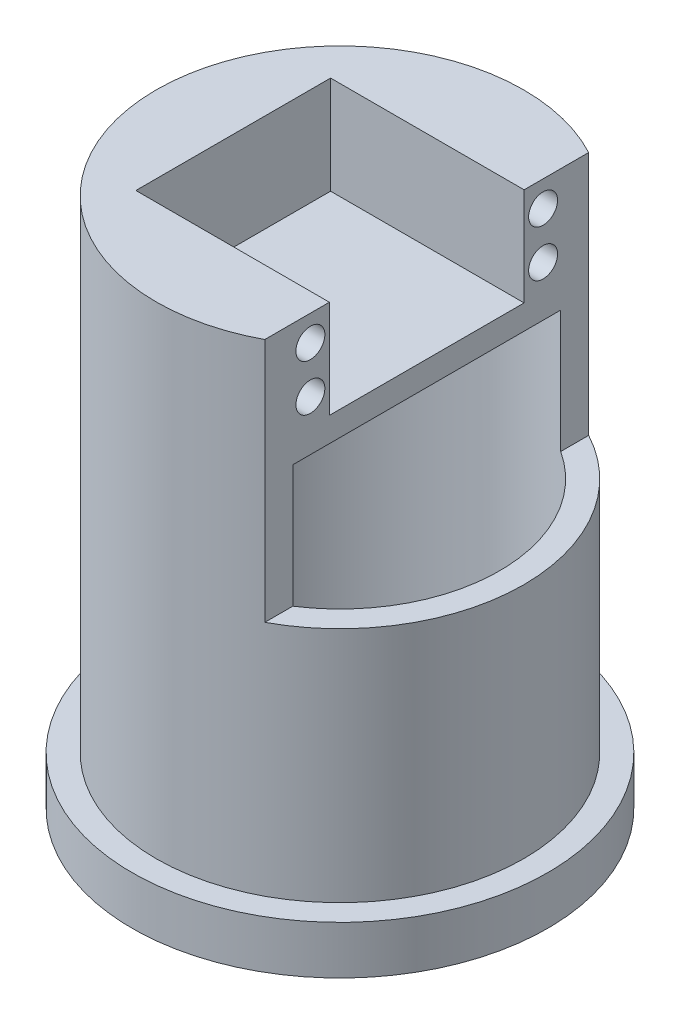
ISO-10303-21;
HEADER;
FILE_DESCRIPTION(('STEP AP214'),'2;1');
FILE_NAME('part.step','',(''),(''),'','','');
FILE_SCHEMA(('AUTOMOTIVE_DESIGN { 1 0 10303 214 1 1 1 1 }'));
ENDSEC;
DATA;
#1=APPLICATION_CONTEXT('core data for automotive mechanical design processes');
#2=APPLICATION_PROTOCOL_DEFINITION('international standard','automotive_design',2000,#1);
#3=PRODUCT_CONTEXT('',#1,'mechanical');
#4=PRODUCT('Part','Part','',(#3));
#5=PRODUCT_RELATED_PRODUCT_CATEGORY('part','',(#4));
#6=PRODUCT_DEFINITION_FORMATION('','',#4);
#7=PRODUCT_DEFINITION_CONTEXT('part definition',#1,'design');
#8=PRODUCT_DEFINITION('design','',#6,#7);
#9=PRODUCT_DEFINITION_SHAPE('','',#8);
#10=(LENGTH_UNIT() NAMED_UNIT(*) SI_UNIT(.MILLI.,.METRE.));
#11=(NAMED_UNIT(*) PLANE_ANGLE_UNIT() SI_UNIT($,.RADIAN.));
#12=(NAMED_UNIT(*) SI_UNIT($,.STERADIAN.) SOLID_ANGLE_UNIT());
#13=UNCERTAINTY_MEASURE_WITH_UNIT(LENGTH_MEASURE(1.E-05),#10,'distance_accuracy_value','');
#14=(GEOMETRIC_REPRESENTATION_CONTEXT(3) GLOBAL_UNCERTAINTY_ASSIGNED_CONTEXT((#13)) GLOBAL_UNIT_ASSIGNED_CONTEXT((#10,
#11,#12)) REPRESENTATION_CONTEXT('',''));
#15=CARTESIAN_POINT('',(0.,0.,0.));
#16=DIRECTION('',(0.,0.,1.));
#17=DIRECTION('',(1.,0.,0.));
#18=AXIS2_PLACEMENT_3D('',#15,#16,#17);
#19=CARTESIAN_POINT('',(0.,100.,0.));
#20=DIRECTION('',(0.,-1.,0.));
#21=DIRECTION('',(0.,0.,-1.));
#22=AXIS2_PLACEMENT_3D('',#19,#20,#21);
#23=CYLINDRICAL_SURFACE('',#22,38.1);
#24=CARTESIAN_POINT('',(0.,100.,0.));
#25=DIRECTION('',(0.,1.,0.));
#26=DIRECTION('',(0.,0.,1.));
#27=AXIS2_PLACEMENT_3D('',#24,#25,#26);
#28=CIRCLE('',#27,38.1);
#29=CARTESIAN_POINT('',(18.,100.,-33.5799047050464));
#30=VERTEX_POINT('',#29);
#31=CARTESIAN_POINT('',(18.,100.,33.5799047050464));
#32=VERTEX_POINT('',#31);
#33=EDGE_CURVE('E352',#30,#32,#28,.T.);
#34=ORIENTED_EDGE('',*,*,#33,.F.);
#35=DIRECTION('',(0.,-1.,0.));
#36=VECTOR('',#35,1.);
#37=CARTESIAN_POINT('',(18.,100.,-33.5799047050464));
#38=LINE('',#37,#36);
#39=CARTESIAN_POINT('',(18.,49.2,-33.5799047050464));
#40=VERTEX_POINT('',#39);
#41=EDGE_CURVE('E241',#30,#40,#38,.T.);
#42=ORIENTED_EDGE('',*,*,#41,.T.);
#43=CARTESIAN_POINT('',(0.,49.2,0.));
#44=DIRECTION('',(0.,-1.,0.));
#45=DIRECTION('',(0.,0.,-1.));
#46=AXIS2_PLACEMENT_3D('',#43,#44,#45);
#47=CIRCLE('',#46,38.1);
#48=CARTESIAN_POINT('',(18.,49.2,33.5799047050464));
#49=VERTEX_POINT('',#48);
#50=EDGE_CURVE('E245',#40,#49,#47,.T.);
#51=ORIENTED_EDGE('',*,*,#50,.T.);
#52=DIRECTION('',(0.,-1.,0.));
#53=VECTOR('',#52,1.);
#54=CARTESIAN_POINT('',(18.,100.,33.5799047050464));
#55=LINE('',#54,#53);
#56=EDGE_CURVE('E234',#49,#32,#55,.F.);
#57=ORIENTED_EDGE('',*,*,#56,.T.);
#58=EDGE_LOOP('',(#34,#42,#51,#57));
#59=FACE_BOUND('',#58,.T.);
#60=CARTESIAN_POINT('',(0.,0.,0.));
#61=DIRECTION('',(0.,1.,0.));
#62=DIRECTION('',(0.,0.,1.));
#63=AXIS2_PLACEMENT_3D('',#60,#61,#62);
#64=CIRCLE('',#63,38.1);
#65=CARTESIAN_POINT('',(0.,0.,38.1));
#66=VERTEX_POINT('',#65);
#67=EDGE_CURVE('E348',#66,#66,#64,.T.);
#68=ORIENTED_EDGE('',*,*,#67,.T.);
#69=EDGE_LOOP('',(#68));
#70=FACE_BOUND('',#69,.T.);
#71=ADVANCED_FACE('F39',(#59,#70),#23,.T.);
#72=CARTESIAN_POINT('',(0.,100.,0.));
#73=DIRECTION('',(0.,1.,0.));
#74=DIRECTION('',(0.,0.,1.));
#75=AXIS2_PLACEMENT_3D('',#72,#73,#74);
#76=PLANE('',#75);
#77=DIRECTION('',(1.,0.,0.));
#78=VECTOR('',#77,1.);
#79=CARTESIAN_POINT('',(-22.132,100.,-20.193));
#80=LINE('',#79,#78);
#81=CARTESIAN_POINT('',(-22.132,100.,-20.193));
#82=VERTEX_POINT('',#81);
#83=CARTESIAN_POINT('',(18.,100.,-20.193));
#84=VERTEX_POINT('',#83);
#85=EDGE_CURVE('E152',#82,#84,#80,.T.);
#86=ORIENTED_EDGE('',*,*,#85,.T.);
#87=DIRECTION('',(0.,0.,-1.));
#88=VECTOR('',#87,1.);
#89=CARTESIAN_POINT('',(18.,100.,-33.5799047050464));
#90=LINE('',#89,#88);
#91=EDGE_CURVE('E249',#84,#30,#90,.T.);
#92=ORIENTED_EDGE('',*,*,#91,.T.);
#93=ORIENTED_EDGE('',*,*,#33,.T.);
#94=CARTESIAN_POINT('',(18.,100.,20.193));
#95=VERTEX_POINT('',#94);
#96=EDGE_CURVE('E255',#32,#95,#90,.T.);
#97=ORIENTED_EDGE('',*,*,#96,.T.);
#98=DIRECTION('',(1.,0.,0.));
#99=VECTOR('',#98,1.);
#100=CARTESIAN_POINT('',(-22.132,100.,20.193));
#101=LINE('',#100,#99);
#102=CARTESIAN_POINT('',(-22.132,100.,20.193));
#103=VERTEX_POINT('',#102);
#104=EDGE_CURVE('E54',#103,#95,#101,.T.);
#105=ORIENTED_EDGE('',*,*,#104,.F.);
#106=DIRECTION('',(0.,0.,1.));
#107=VECTOR('',#106,1.);
#108=CARTESIAN_POINT('',(-22.132,100.,20.193));
#109=LINE('',#108,#107);
#110=EDGE_CURVE('E169',#82,#103,#109,.T.);
#111=ORIENTED_EDGE('',*,*,#110,.F.);
#112=EDGE_LOOP('',(#86,#92,#93,#97,#105,#111));
#113=FACE_BOUND('',#112,.T.);
#114=ADVANCED_FACE('F174',(#113),#76,.T.);
#115=CARTESIAN_POINT('',(0.,100.,0.));
#116=DIRECTION('',(0.,-1.,0.));
#117=DIRECTION('',(0.,0.,-1.));
#118=AXIS2_PLACEMENT_3D('',#115,#116,#117);
#119=CYLINDRICAL_SURFACE('',#118,33.1);
#120=DIRECTION('',(0.,-1.,0.));
#121=VECTOR('',#120,1.);
#122=CARTESIAN_POINT('',(18.,100.,-27.7778688887395));
#123=LINE('',#122,#121);
#124=CARTESIAN_POINT('',(18.,74.6,-27.7778688887395));
#125=VERTEX_POINT('',#124);
#126=CARTESIAN_POINT('',(18.,49.2,-27.7778688887395));
#127=VERTEX_POINT('',#126);
#128=EDGE_CURVE('E235',#125,#127,#123,.T.);
#129=ORIENTED_EDGE('',*,*,#128,.F.);
#130=CARTESIAN_POINT('',(0.,74.6,0.));
#131=DIRECTION('',(0.,1.,0.));
#132=DIRECTION('',(0.,0.,1.));
#133=AXIS2_PLACEMENT_3D('',#130,#131,#132);
#134=CIRCLE('',#133,33.1);
#135=CARTESIAN_POINT('',(18.,74.6,27.7778688887395));
#136=VERTEX_POINT('',#135);
#137=EDGE_CURVE('E47',#125,#136,#134,.T.);
#138=ORIENTED_EDGE('',*,*,#137,.T.);
#139=DIRECTION('',(0.,-1.,0.));
#140=VECTOR('',#139,1.);
#141=CARTESIAN_POINT('',(18.,100.,27.7778688887395));
#142=LINE('',#141,#140);
#143=CARTESIAN_POINT('',(18.,49.2,27.7778688887395));
#144=VERTEX_POINT('',#143);
#145=EDGE_CURVE('E231',#144,#136,#142,.F.);
#146=ORIENTED_EDGE('',*,*,#145,.F.);
#147=CARTESIAN_POINT('',(0.,49.2,0.));
#148=DIRECTION('',(0.,-1.,0.));
#149=DIRECTION('',(0.,0.,-1.));
#150=AXIS2_PLACEMENT_3D('',#147,#148,#149);
#151=CIRCLE('',#150,33.1);
#152=EDGE_CURVE('E11',#127,#144,#151,.T.);
#153=ORIENTED_EDGE('',*,*,#152,.F.);
#154=EDGE_LOOP('',(#129,#138,#146,#153));
#155=FACE_BOUND('',#154,.T.);
#156=DIRECTION('',(0.,-1.,0.));
#157=VECTOR('',#156,1.);
#158=CARTESIAN_POINT('',(13.,-5.,-30.4402693811996));
#159=LINE('',#158,#157);
#160=CARTESIAN_POINT('',(13.,-5.,-30.4402693811996));
#161=VERTEX_POINT('',#160);
#162=CARTESIAN_POINT('',(13.,-10.,-30.4402693811996));
#163=VERTEX_POINT('',#162);
#164=EDGE_CURVE('E329',#161,#163,#159,.T.);
#165=ORIENTED_EDGE('',*,*,#164,.T.);
#166=CARTESIAN_POINT('',(0.,-10.,0.));
#167=DIRECTION('',(0.,-1.,0.));
#168=DIRECTION('',(0.,0.,-1.));
#169=AXIS2_PLACEMENT_3D('',#166,#167,#168);
#170=CIRCLE('',#169,33.1);
#171=CARTESIAN_POINT('',(13.,-10.,30.4402693811996));
#172=VERTEX_POINT('',#171);
#173=EDGE_CURVE('E340',#163,#172,#170,.T.);
#174=ORIENTED_EDGE('',*,*,#173,.T.);
#175=DIRECTION('',(0.,-1.,0.));
#176=VECTOR('',#175,1.);
#177=CARTESIAN_POINT('',(13.,-5.,30.4402693811997));
#178=LINE('',#177,#176);
#179=CARTESIAN_POINT('',(13.,-5.,30.4402693811996));
#180=VERTEX_POINT('',#179);
#181=EDGE_CURVE('E324',#180,#172,#178,.T.);
#182=ORIENTED_EDGE('',*,*,#181,.F.);
#183=CARTESIAN_POINT('',(0.,-5.,0.));
#184=DIRECTION('',(0.,-1.,0.));
#185=DIRECTION('',(0.,0.,1.));
#186=AXIS2_PLACEMENT_3D('',#183,#184,#185);
#187=CIRCLE('',#186,33.1);
#188=CARTESIAN_POINT('',(-13.,-5.,30.4402693811996));
#189=VERTEX_POINT('',#188);
#190=EDGE_CURVE('E302',#180,#189,#187,.T.);
#191=ORIENTED_EDGE('',*,*,#190,.T.);
#192=DIRECTION('',(0.,-1.,0.));
#193=VECTOR('',#192,1.);
#194=CARTESIAN_POINT('',(-13.,-5.,30.4402693811996));
#195=LINE('',#194,#193);
#196=CARTESIAN_POINT('',(-13.,-10.,30.4402693811996));
#197=VERTEX_POINT('',#196);
#198=EDGE_CURVE('E317',#189,#197,#195,.T.);
#199=ORIENTED_EDGE('',*,*,#198,.T.);
#200=CARTESIAN_POINT('',(-13.,-10.,-30.4402693811996));
#201=VERTEX_POINT('',#200);
#202=EDGE_CURVE('E328',#197,#201,#170,.T.);
#203=ORIENTED_EDGE('',*,*,#202,.T.);
#204=DIRECTION('',(0.,-1.,0.));
#205=VECTOR('',#204,1.);
#206=CARTESIAN_POINT('',(-13.,-5.,-30.4402693811997));
#207=LINE('',#206,#205);
#208=CARTESIAN_POINT('',(-13.,-5.,-30.4402693811996));
#209=VERTEX_POINT('',#208);
#210=EDGE_CURVE('E333',#209,#201,#207,.T.);
#211=ORIENTED_EDGE('',*,*,#210,.F.);
#212=CARTESIAN_POINT('',(0.,-5.,0.));
#213=DIRECTION('',(0.,-1.,0.));
#214=DIRECTION('',(0.,0.,1.));
#215=AXIS2_PLACEMENT_3D('',#212,#213,#214);
#216=CIRCLE('',#215,33.1);
#217=EDGE_CURVE('E310',#209,#161,#216,.T.);
#218=ORIENTED_EDGE('',*,*,#217,.T.);
#219=EDGE_LOOP('',(#165,#174,#182,#191,#199,#203,#211,#218));
#220=FACE_BOUND('',#219,.T.);
#221=ADVANCED_FACE('F364',(#155,#220),#119,.F.);
#222=CARTESIAN_POINT('',(0.,-10.,0.));
#223=DIRECTION('',(0.,-1.,0.));
#224=DIRECTION('',(0.,0.,-1.));
#225=AXIS2_PLACEMENT_3D('',#222,#223,#224);
#226=PLANE('',#225);
#227=CARTESIAN_POINT('',(0.,-10.,0.));
#228=DIRECTION('',(0.,-1.,0.));
#229=DIRECTION('',(0.,0.,-1.));
#230=AXIS2_PLACEMENT_3D('',#227,#228,#229);
#231=CIRCLE('',#230,2.5);
#232=CARTESIAN_POINT('',(-2.,-10.,1.5));
#233=VERTEX_POINT('',#232);
#234=CARTESIAN_POINT('',(-2.,-10.,-1.5));
#235=VERTEX_POINT('',#234);
#236=EDGE_CURVE('E254',#233,#235,#231,.T.);
#237=ORIENTED_EDGE('',*,*,#236,.F.);
#238=DIRECTION('',(-1.,0.,0.));
#239=VECTOR('',#238,1.);
#240=CARTESIAN_POINT('',(-2.,-10.,1.5));
#241=LINE('',#240,#239);
#242=CARTESIAN_POINT('',(2.,-10.,1.5));
#243=VERTEX_POINT('',#242);
#244=EDGE_CURVE('E263',#243,#233,#241,.T.);
#245=ORIENTED_EDGE('',*,*,#244,.F.);
#246=CARTESIAN_POINT('',(0.,-10.,0.));
#247=DIRECTION('',(0.,-1.,0.));
#248=DIRECTION('',(0.,0.,-1.));
#249=AXIS2_PLACEMENT_3D('',#246,#247,#248);
#250=CIRCLE('',#249,2.5);
#251=CARTESIAN_POINT('',(2.,-10.,-1.5));
#252=VERTEX_POINT('',#251);
#253=EDGE_CURVE('E282',#252,#243,#250,.T.);
#254=ORIENTED_EDGE('',*,*,#253,.F.);
#255=DIRECTION('',(1.,0.,0.));
#256=VECTOR('',#255,1.);
#257=CARTESIAN_POINT('',(-2.,-10.,-1.5));
#258=LINE('',#257,#256);
#259=EDGE_CURVE('E278',#235,#252,#258,.T.);
#260=ORIENTED_EDGE('',*,*,#259,.F.);
#261=EDGE_LOOP('',(#237,#245,#254,#260));
#262=FACE_BOUND('',#261,.T.);
#263=ORIENTED_EDGE('',*,*,#202,.F.);
#264=CARTESIAN_POINT('',(-70.,-10.,0.));
#265=DIRECTION('',(0.,1.,0.));
#266=DIRECTION('',(0.,0.,1.));
#267=AXIS2_PLACEMENT_3D('',#264,#265,#266);
#268=CIRCLE('',#267,64.6189600659126);
#269=EDGE_CURVE('E292',#197,#201,#268,.T.);
#270=ORIENTED_EDGE('',*,*,#269,.T.);
#271=EDGE_LOOP('',(#263,#270));
#272=FACE_BOUND('',#271,.T.);
#273=CARTESIAN_POINT('',(0.,-10.,0.));
#274=DIRECTION('',(0.,-1.,0.));
#275=DIRECTION('',(0.,0.,-1.));
#276=AXIS2_PLACEMENT_3D('',#273,#274,#275);
#277=CIRCLE('',#276,43.1);
#278=CARTESIAN_POINT('',(0.,-10.,-43.1));
#279=VERTEX_POINT('',#278);
#280=EDGE_CURVE('E344',#279,#279,#277,.T.);
#281=ORIENTED_EDGE('',*,*,#280,.T.);
#282=EDGE_LOOP('',(#281));
#283=FACE_BOUND('',#282,.T.);
#284=ORIENTED_EDGE('',*,*,#173,.F.);
#285=CARTESIAN_POINT('',(70.,-10.,0.));
#286=DIRECTION('',(0.,1.,0.));
#287=DIRECTION('',(0.,0.,-1.));
#288=AXIS2_PLACEMENT_3D('',#285,#286,#287);
#289=CIRCLE('',#288,64.6189600659126);
#290=EDGE_CURVE('E306',#163,#172,#289,.T.);
#291=ORIENTED_EDGE('',*,*,#290,.T.);
#292=EDGE_LOOP('',(#284,#291));
#293=FACE_BOUND('',#292,.T.);
#294=ADVANCED_FACE('F412',(#262,#272,#283,#293),#226,.T.);
#295=CARTESIAN_POINT('',(0.,0.,0.));
#296=DIRECTION('',(0.,-1.,0.));
#297=DIRECTION('',(0.,0.,-1.));
#298=AXIS2_PLACEMENT_3D('',#295,#296,#297);
#299=PLANE('',#298);
#300=ORIENTED_EDGE('',*,*,#67,.F.);
#301=EDGE_LOOP('',(#300));
#302=FACE_BOUND('',#301,.T.);
#303=CARTESIAN_POINT('',(0.,0.,0.));
#304=DIRECTION('',(0.,-1.,0.));
#305=DIRECTION('',(0.,0.,-1.));
#306=AXIS2_PLACEMENT_3D('',#303,#304,#305);
#307=CIRCLE('',#306,43.1);
#308=CARTESIAN_POINT('',(0.,0.,-43.1));
#309=VERTEX_POINT('',#308);
#310=EDGE_CURVE('E343',#309,#309,#307,.T.);
#311=ORIENTED_EDGE('',*,*,#310,.F.);
#312=EDGE_LOOP('',(#311));
#313=FACE_BOUND('',#312,.T.);
#314=ADVANCED_FACE('F418',(#302,#313),#299,.F.);
#315=CARTESIAN_POINT('',(0.,-10.,0.));
#316=DIRECTION('',(0.,1.,0.));
#317=DIRECTION('',(0.,0.,1.));
#318=AXIS2_PLACEMENT_3D('',#315,#316,#317);
#319=CYLINDRICAL_SURFACE('',#318,43.1);
#320=ORIENTED_EDGE('',*,*,#280,.F.);
#321=EDGE_LOOP('',(#320));
#322=FACE_BOUND('',#321,.T.);
#323=ORIENTED_EDGE('',*,*,#310,.T.);
#324=EDGE_LOOP('',(#323));
#325=FACE_BOUND('',#324,.T.);
#326=ADVANCED_FACE('F415',(#322,#325),#319,.T.);
#327=CARTESIAN_POINT('',(70.,-5.,0.));
#328=DIRECTION('',(0.,-1.,0.));
#329=DIRECTION('',(0.,0.,-1.));
#330=AXIS2_PLACEMENT_3D('',#327,#328,#329);
#331=CYLINDRICAL_SURFACE('',#330,64.6189600659126);
#332=ORIENTED_EDGE('',*,*,#290,.F.);
#333=ORIENTED_EDGE('',*,*,#164,.F.);
#334=CARTESIAN_POINT('',(70.,-5.,0.));
#335=DIRECTION('',(0.,1.,0.));
#336=DIRECTION('',(0.,0.,-1.));
#337=AXIS2_PLACEMENT_3D('',#334,#335,#336);
#338=CIRCLE('',#337,64.6189600659126);
#339=EDGE_CURVE('E313',#161,#180,#338,.T.);
#340=ORIENTED_EDGE('',*,*,#339,.T.);
#341=ORIENTED_EDGE('',*,*,#181,.T.);
#342=EDGE_LOOP('',(#332,#333,#340,#341));
#343=FACE_BOUND('',#342,.T.);
#344=ADVANCED_FACE('F417',(#343),#331,.F.);
#345=CARTESIAN_POINT('',(-70.,-5.,0.));
#346=DIRECTION('',(0.,-1.,0.));
#347=DIRECTION('',(0.,0.,-1.));
#348=AXIS2_PLACEMENT_3D('',#345,#346,#347);
#349=CYLINDRICAL_SURFACE('',#348,64.6189600659126);
#350=ORIENTED_EDGE('',*,*,#269,.F.);
#351=ORIENTED_EDGE('',*,*,#198,.F.);
#352=CARTESIAN_POINT('',(-70.,-5.,0.));
#353=DIRECTION('',(0.,1.,0.));
#354=DIRECTION('',(0.,0.,1.));
#355=AXIS2_PLACEMENT_3D('',#352,#353,#354);
#356=CIRCLE('',#355,64.6189600659126);
#357=EDGE_CURVE('E305',#189,#209,#356,.T.);
#358=ORIENTED_EDGE('',*,*,#357,.T.);
#359=ORIENTED_EDGE('',*,*,#210,.T.);
#360=EDGE_LOOP('',(#350,#351,#358,#359));
#361=FACE_BOUND('',#360,.T.);
#362=ADVANCED_FACE('F425',(#361),#349,.F.);
#363=CARTESIAN_POINT('',(35.,-5.,0.));
#364=DIRECTION('',(0.,1.,0.));
#365=DIRECTION('',(0.,0.,1.));
#366=AXIS2_PLACEMENT_3D('',#363,#364,#365);
#367=PLANE('',#366);
#368=CARTESIAN_POINT('',(0.,-5.,0.));
#369=DIRECTION('',(0.,-1.,0.));
#370=DIRECTION('',(0.,0.,-1.));
#371=AXIS2_PLACEMENT_3D('',#368,#369,#370);
#372=CIRCLE('',#371,2.5);
#373=CARTESIAN_POINT('',(-2.,-5.,1.5));
#374=VERTEX_POINT('',#373);
#375=CARTESIAN_POINT('',(-2.,-5.,-1.5));
#376=VERTEX_POINT('',#375);
#377=EDGE_CURVE('E258',#374,#376,#372,.T.);
#378=ORIENTED_EDGE('',*,*,#377,.T.);
#379=DIRECTION('',(1.,0.,0.));
#380=VECTOR('',#379,1.);
#381=CARTESIAN_POINT('',(-2.,-5.,-1.5));
#382=LINE('',#381,#380);
#383=CARTESIAN_POINT('',(2.,-5.,-1.5));
#384=VERTEX_POINT('',#383);
#385=EDGE_CURVE('E262',#376,#384,#382,.T.);
#386=ORIENTED_EDGE('',*,*,#385,.T.);
#387=CARTESIAN_POINT('',(0.,-5.,0.));
#388=DIRECTION('',(0.,-1.,0.));
#389=DIRECTION('',(0.,0.,-1.));
#390=AXIS2_PLACEMENT_3D('',#387,#388,#389);
#391=CIRCLE('',#390,2.5);
#392=CARTESIAN_POINT('',(2.,-5.,1.5));
#393=VERTEX_POINT('',#392);
#394=EDGE_CURVE('E267',#384,#393,#391,.T.);
#395=ORIENTED_EDGE('',*,*,#394,.T.);
#396=DIRECTION('',(-1.,0.,0.));
#397=VECTOR('',#396,1.);
#398=CARTESIAN_POINT('',(-2.,-5.,1.5));
#399=LINE('',#398,#397);
#400=EDGE_CURVE('E271',#393,#374,#399,.T.);
#401=ORIENTED_EDGE('',*,*,#400,.T.);
#402=EDGE_LOOP('',(#378,#386,#395,#401));
#403=FACE_BOUND('',#402,.T.);
#404=ORIENTED_EDGE('',*,*,#190,.F.);
#405=ORIENTED_EDGE('',*,*,#339,.F.);
#406=ORIENTED_EDGE('',*,*,#217,.F.);
#407=ORIENTED_EDGE('',*,*,#357,.F.);
#408=EDGE_LOOP('',(#404,#405,#406,#407));
#409=FACE_BOUND('',#408,.T.);
#410=ADVANCED_FACE('F428',(#403,#409),#367,.T.);
#411=CARTESIAN_POINT('',(0.,-5.,0.));
#412=DIRECTION('',(0.,-1.,0.));
#413=DIRECTION('',(0.,0.,-1.));
#414=AXIS2_PLACEMENT_3D('',#411,#412,#413);
#415=CYLINDRICAL_SURFACE('',#414,2.5);
#416=ORIENTED_EDGE('',*,*,#236,.T.);
#417=DIRECTION('',(0.,-1.,0.));
#418=VECTOR('',#417,1.);
#419=CARTESIAN_POINT('',(-2.,-5.,-1.5));
#420=LINE('',#419,#418);
#421=EDGE_CURVE('E275',#376,#235,#420,.T.);
#422=ORIENTED_EDGE('',*,*,#421,.F.);
#423=ORIENTED_EDGE('',*,*,#377,.F.);
#424=DIRECTION('',(0.,-1.,0.));
#425=VECTOR('',#424,1.);
#426=CARTESIAN_POINT('',(-2.,-5.,1.5));
#427=LINE('',#426,#425);
#428=EDGE_CURVE('E289',#374,#233,#427,.T.);
#429=ORIENTED_EDGE('',*,*,#428,.T.);
#430=EDGE_LOOP('',(#416,#422,#423,#429));
#431=FACE_BOUND('',#430,.T.);
#432=ADVANCED_FACE('F435',(#431),#415,.F.);
#433=CARTESIAN_POINT('',(-2.,-5.,1.5));
#434=DIRECTION('',(0.,0.,1.));
#435=DIRECTION('',(1.,0.,0.));
#436=AXIS2_PLACEMENT_3D('',#433,#434,#435);
#437=PLANE('',#436);
#438=ORIENTED_EDGE('',*,*,#244,.T.);
#439=ORIENTED_EDGE('',*,*,#428,.F.);
#440=ORIENTED_EDGE('',*,*,#400,.F.);
#441=DIRECTION('',(0.,-1.,0.));
#442=VECTOR('',#441,1.);
#443=CARTESIAN_POINT('',(2.,-5.,1.5));
#444=LINE('',#443,#442);
#445=EDGE_CURVE('E293',#393,#243,#444,.T.);
#446=ORIENTED_EDGE('',*,*,#445,.T.);
#447=EDGE_LOOP('',(#438,#439,#440,#446));
#448=FACE_BOUND('',#447,.T.);
#449=ADVANCED_FACE('F439',(#448),#437,.F.);
#450=CARTESIAN_POINT('',(0.,-5.,0.));
#451=DIRECTION('',(0.,-1.,0.));
#452=DIRECTION('',(0.,0.,-1.));
#453=AXIS2_PLACEMENT_3D('',#450,#451,#452);
#454=CYLINDRICAL_SURFACE('',#453,2.5);
#455=ORIENTED_EDGE('',*,*,#253,.T.);
#456=ORIENTED_EDGE('',*,*,#445,.F.);
#457=ORIENTED_EDGE('',*,*,#394,.F.);
#458=DIRECTION('',(0.,-1.,0.));
#459=VECTOR('',#458,1.);
#460=CARTESIAN_POINT('',(2.,-5.,-1.5));
#461=LINE('',#460,#459);
#462=EDGE_CURVE('E296',#384,#252,#461,.T.);
#463=ORIENTED_EDGE('',*,*,#462,.T.);
#464=EDGE_LOOP('',(#455,#456,#457,#463));
#465=FACE_BOUND('',#464,.T.);
#466=ADVANCED_FACE('F443',(#465),#454,.F.);
#467=CARTESIAN_POINT('',(-2.,-5.,-1.5));
#468=DIRECTION('',(0.,0.,-1.));
#469=DIRECTION('',(-1.,0.,0.));
#470=AXIS2_PLACEMENT_3D('',#467,#468,#469);
#471=PLANE('',#470);
#472=ORIENTED_EDGE('',*,*,#259,.T.);
#473=ORIENTED_EDGE('',*,*,#462,.F.);
#474=ORIENTED_EDGE('',*,*,#385,.F.);
#475=ORIENTED_EDGE('',*,*,#421,.T.);
#476=EDGE_LOOP('',(#472,#473,#474,#475));
#477=FACE_BOUND('',#476,.T.);
#478=ADVANCED_FACE('F397',(#477),#471,.F.);
#479=CARTESIAN_POINT('',(0.,74.6,0.));
#480=DIRECTION('',(0.,1.,0.));
#481=DIRECTION('',(0.,0.,1.));
#482=AXIS2_PLACEMENT_3D('',#479,#480,#481);
#483=PLANE('',#482);
#484=ORIENTED_EDGE('',*,*,#137,.F.);
#485=DIRECTION('',(0.,0.,-1.));
#486=VECTOR('',#485,1.);
#487=CARTESIAN_POINT('',(18.,74.6,-33.5799047050464));
#488=LINE('',#487,#486);
#489=EDGE_CURVE('E250',#136,#125,#488,.T.);
#490=ORIENTED_EDGE('',*,*,#489,.F.);
#491=EDGE_LOOP('',(#484,#490));
#492=FACE_BOUND('',#491,.T.);
#493=ADVANCED_FACE('F368',(#492),#483,.F.);
#494=CARTESIAN_POINT('',(18.,74.6,-33.5799047050464));
#495=DIRECTION('',(1.,0.,0.));
#496=DIRECTION('',(0.,0.,-1.));
#497=AXIS2_PLACEMENT_3D('',#494,#495,#496);
#498=PLANE('',#497);
#499=CARTESIAN_POINT('',(18.,85.014,24.13));
#500=DIRECTION('',(1.,0.,0.));
#501=DIRECTION('',(0.,0.,-1.));
#502=AXIS2_PLACEMENT_3D('',#499,#500,#501);
#503=CIRCLE('',#502,3.);
#504=CARTESIAN_POINT('',(18.,85.014,21.13));
#505=VERTEX_POINT('',#504);
#506=EDGE_CURVE('E207',#505,#505,#503,.T.);
#507=ORIENTED_EDGE('',*,*,#506,.F.);
#508=EDGE_LOOP('',(#507));
#509=FACE_BOUND('',#508,.T.);
#510=CARTESIAN_POINT('',(18.,85.014,-24.13));
#511=DIRECTION('',(1.,0.,0.));
#512=DIRECTION('',(0.,0.,1.));
#513=AXIS2_PLACEMENT_3D('',#510,#511,#512);
#514=CIRCLE('',#513,3.);
#515=CARTESIAN_POINT('',(18.,85.014,-21.13));
#516=VERTEX_POINT('',#515);
#517=EDGE_CURVE('E215',#516,#516,#514,.T.);
#518=ORIENTED_EDGE('',*,*,#517,.F.);
#519=EDGE_LOOP('',(#518));
#520=FACE_BOUND('',#519,.T.);
#521=CARTESIAN_POINT('',(18.,94.666,-24.13));
#522=DIRECTION('',(1.,0.,0.));
#523=DIRECTION('',(0.,0.,1.));
#524=AXIS2_PLACEMENT_3D('',#521,#522,#523);
#525=CIRCLE('',#524,3.);
#526=CARTESIAN_POINT('',(18.,94.666,-21.13));
#527=VERTEX_POINT('',#526);
#528=EDGE_CURVE('E196',#527,#527,#525,.T.);
#529=ORIENTED_EDGE('',*,*,#528,.F.);
#530=EDGE_LOOP('',(#529));
#531=FACE_BOUND('',#530,.T.);
#532=DIRECTION('',(0.,1.,0.));
#533=VECTOR('',#532,1.);
#534=CARTESIAN_POINT('',(18.,79.68,-20.193));
#535=LINE('',#534,#533);
#536=CARTESIAN_POINT('',(18.,79.68,-20.193));
#537=VERTEX_POINT('',#536);
#538=EDGE_CURVE('E158',#537,#84,#535,.T.);
#539=ORIENTED_EDGE('',*,*,#538,.F.);
#540=DIRECTION('',(0.,0.,-1.));
#541=VECTOR('',#540,1.);
#542=CARTESIAN_POINT('',(18.,79.68,20.193));
#543=LINE('',#542,#541);
#544=CARTESIAN_POINT('',(18.,79.68,20.193));
#545=VERTEX_POINT('',#544);
#546=EDGE_CURVE('E172',#545,#537,#543,.T.);
#547=ORIENTED_EDGE('',*,*,#546,.F.);
#548=DIRECTION('',(0.,-1.,0.));
#549=VECTOR('',#548,1.);
#550=CARTESIAN_POINT('',(18.,79.68,20.193));
#551=LINE('',#550,#549);
#552=EDGE_CURVE('E187',#95,#545,#551,.T.);
#553=ORIENTED_EDGE('',*,*,#552,.F.);
#554=ORIENTED_EDGE('',*,*,#96,.F.);
#555=ORIENTED_EDGE('',*,*,#56,.F.);
#556=DIRECTION('',(0.,0.,1.));
#557=VECTOR('',#556,1.);
#558=CARTESIAN_POINT('',(18.,49.2,42.9553209980651));
#559=LINE('',#558,#557);
#560=EDGE_CURVE('E224',#144,#49,#559,.T.);
#561=ORIENTED_EDGE('',*,*,#560,.F.);
#562=ORIENTED_EDGE('',*,*,#145,.T.);
#563=ORIENTED_EDGE('',*,*,#489,.T.);
#564=ORIENTED_EDGE('',*,*,#128,.T.);
#565=EDGE_CURVE('E61',#40,#127,#559,.T.);
#566=ORIENTED_EDGE('',*,*,#565,.F.);
#567=ORIENTED_EDGE('',*,*,#41,.F.);
#568=ORIENTED_EDGE('',*,*,#91,.F.);
#569=EDGE_LOOP('',(#539,#547,#553,#554,#555,#561,#562,#563,#564,#566,#567,#568));
#570=FACE_BOUND('',#569,.T.);
#571=CARTESIAN_POINT('',(18.,94.666,24.13));
#572=DIRECTION('',(1.,0.,0.));
#573=DIRECTION('',(0.,0.,-1.));
#574=AXIS2_PLACEMENT_3D('',#571,#572,#573);
#575=CIRCLE('',#574,3.);
#576=CARTESIAN_POINT('',(18.,94.666,21.13));
#577=VERTEX_POINT('',#576);
#578=EDGE_CURVE('E206',#577,#577,#575,.T.);
#579=ORIENTED_EDGE('',*,*,#578,.F.);
#580=EDGE_LOOP('',(#579));
#581=FACE_BOUND('',#580,.T.);
#582=ADVANCED_FACE('F370',(#509,#520,#531,#570,#581),#498,.T.);
#583=CARTESIAN_POINT('',(8.21659038054796,49.2,0.));
#584=DIRECTION('',(0.,-1.,0.));
#585=DIRECTION('',(0.,0.,-1.));
#586=AXIS2_PLACEMENT_3D('',#583,#584,#585);
#587=PLANE('',#586);
#588=ORIENTED_EDGE('',*,*,#565,.T.);
#589=ORIENTED_EDGE('',*,*,#152,.T.);
#590=ORIENTED_EDGE('',*,*,#560,.T.);
#591=ORIENTED_EDGE('',*,*,#50,.F.);
#592=EDGE_LOOP('',(#588,#589,#590,#591));
#593=FACE_BOUND('',#592,.T.);
#594=ADVANCED_FACE('F373',(#593),#587,.F.);
#595=CARTESIAN_POINT('',(-22.132,94.666,24.13));
#596=DIRECTION('',(1.,0.,0.));
#597=DIRECTION('',(0.,0.,-1.));
#598=AXIS2_PLACEMENT_3D('',#595,#596,#597);
#599=CYLINDRICAL_SURFACE('',#598,3.);
#600=CARTESIAN_POINT('',(-22.132,94.666,24.13));
#601=DIRECTION('',(1.,0.,0.));
#602=DIRECTION('',(0.,0.,-1.));
#603=AXIS2_PLACEMENT_3D('',#600,#601,#602);
#604=CIRCLE('',#603,3.);
#605=CARTESIAN_POINT('',(-22.132,94.666,21.13));
#606=VERTEX_POINT('',#605);
#607=EDGE_CURVE('E220',#606,#606,#604,.T.);
#608=ORIENTED_EDGE('',*,*,#607,.F.);
#609=EDGE_LOOP('',(#608));
#610=FACE_BOUND('',#609,.T.);
#611=ORIENTED_EDGE('',*,*,#578,.T.);
#612=EDGE_LOOP('',(#611));
#613=FACE_BOUND('',#612,.T.);
#614=ADVANCED_FACE('F395',(#610,#613),#599,.F.);
#615=CARTESIAN_POINT('',(-22.132,94.666,24.13));
#616=DIRECTION('',(1.,0.,0.));
#617=DIRECTION('',(0.,0.,-1.));
#618=AXIS2_PLACEMENT_3D('',#615,#616,#617);
#619=PLANE('',#618);
#620=ORIENTED_EDGE('',*,*,#607,.T.);
#621=EDGE_LOOP('',(#620));
#622=FACE_BOUND('',#621,.T.);
#623=ADVANCED_FACE('F482',(#622),#619,.T.);
#624=CARTESIAN_POINT('',(-22.132,79.68,-20.193));
#625=DIRECTION('',(0.,0.,-1.));
#626=DIRECTION('',(-1.,0.,0.));
#627=AXIS2_PLACEMENT_3D('',#624,#625,#626);
#628=PLANE('',#627);
#629=ORIENTED_EDGE('',*,*,#538,.T.);
#630=ORIENTED_EDGE('',*,*,#85,.F.);
#631=DIRECTION('',(0.,1.,0.));
#632=VECTOR('',#631,1.);
#633=CARTESIAN_POINT('',(-22.132,79.68,-20.193));
#634=LINE('',#633,#632);
#635=CARTESIAN_POINT('',(-22.132,79.68,-20.193));
#636=VERTEX_POINT('',#635);
#637=EDGE_CURVE('E155',#636,#82,#634,.T.);
#638=ORIENTED_EDGE('',*,*,#637,.F.);
#639=DIRECTION('',(1.,0.,0.));
#640=VECTOR('',#639,1.);
#641=CARTESIAN_POINT('',(-22.132,79.68,-20.193));
#642=LINE('',#641,#640);
#643=EDGE_CURVE('E193',#636,#537,#642,.T.);
#644=ORIENTED_EDGE('',*,*,#643,.T.);
#645=EDGE_LOOP('',(#629,#630,#638,#644));
#646=FACE_BOUND('',#645,.T.);
#647=ADVANCED_FACE('F154',(#646),#628,.F.);
#648=CARTESIAN_POINT('',(-22.132,79.68,20.193));
#649=DIRECTION('',(0.,-1.,0.));
#650=DIRECTION('',(0.,0.,-1.));
#651=AXIS2_PLACEMENT_3D('',#648,#649,#650);
#652=PLANE('',#651);
#653=ORIENTED_EDGE('',*,*,#546,.T.);
#654=ORIENTED_EDGE('',*,*,#643,.F.);
#655=DIRECTION('',(0.,0.,-1.));
#656=VECTOR('',#655,1.);
#657=CARTESIAN_POINT('',(-22.132,79.68,20.193));
#658=LINE('',#657,#656);
#659=CARTESIAN_POINT('',(-22.132,79.68,20.193));
#660=VERTEX_POINT('',#659);
#661=EDGE_CURVE('E163',#660,#636,#658,.T.);
#662=ORIENTED_EDGE('',*,*,#661,.F.);
#663=DIRECTION('',(1.,0.,0.));
#664=VECTOR('',#663,1.);
#665=CARTESIAN_POINT('',(-22.132,79.68,20.193));
#666=LINE('',#665,#664);
#667=EDGE_CURVE('E197',#660,#545,#666,.T.);
#668=ORIENTED_EDGE('',*,*,#667,.T.);
#669=EDGE_LOOP('',(#653,#654,#662,#668));
#670=FACE_BOUND('',#669,.T.);
#671=ADVANCED_FACE('F474',(#670),#652,.F.);
#672=CARTESIAN_POINT('',(-22.132,79.68,20.193));
#673=DIRECTION('',(0.,0.,1.));
#674=DIRECTION('',(1.,0.,0.));
#675=AXIS2_PLACEMENT_3D('',#672,#673,#674);
#676=PLANE('',#675);
#677=ORIENTED_EDGE('',*,*,#552,.T.);
#678=ORIENTED_EDGE('',*,*,#667,.F.);
#679=DIRECTION('',(0.,-1.,0.));
#680=VECTOR('',#679,1.);
#681=CARTESIAN_POINT('',(-22.132,79.68,20.193));
#682=LINE('',#681,#680);
#683=EDGE_CURVE('E177',#103,#660,#682,.T.);
#684=ORIENTED_EDGE('',*,*,#683,.F.);
#685=ORIENTED_EDGE('',*,*,#104,.T.);
#686=EDGE_LOOP('',(#677,#678,#684,#685));
#687=FACE_BOUND('',#686,.T.);
#688=ADVANCED_FACE('F472',(#687),#676,.F.);
#689=CARTESIAN_POINT('',(-22.132,0.,0.));
#690=DIRECTION('',(-1.,0.,0.));
#691=DIRECTION('',(0.,0.,1.));
#692=AXIS2_PLACEMENT_3D('',#689,#690,#691);
#693=PLANE('',#692);
#694=ORIENTED_EDGE('',*,*,#637,.T.);
#695=ORIENTED_EDGE('',*,*,#110,.T.);
#696=ORIENTED_EDGE('',*,*,#683,.T.);
#697=ORIENTED_EDGE('',*,*,#661,.T.);
#698=EDGE_LOOP('',(#694,#695,#696,#697));
#699=FACE_BOUND('',#698,.T.);
#700=ADVANCED_FACE('F167',(#699),#693,.F.);
#701=CARTESIAN_POINT('',(-22.132,94.666,-24.13));
#702=DIRECTION('',(1.,0.,0.));
#703=DIRECTION('',(0.,0.,-1.));
#704=AXIS2_PLACEMENT_3D('',#701,#702,#703);
#705=CYLINDRICAL_SURFACE('',#704,3.);
#706=CARTESIAN_POINT('',(-22.132,94.666,-24.13));
#707=DIRECTION('',(1.,0.,0.));
#708=DIRECTION('',(0.,0.,1.));
#709=AXIS2_PLACEMENT_3D('',#706,#707,#708);
#710=CIRCLE('',#709,3.);
#711=CARTESIAN_POINT('',(-22.132,94.666,-21.13));
#712=VERTEX_POINT('',#711);
#713=EDGE_CURVE('E219',#712,#712,#710,.T.);
#714=ORIENTED_EDGE('',*,*,#713,.F.);
#715=EDGE_LOOP('',(#714));
#716=FACE_BOUND('',#715,.T.);
#717=ORIENTED_EDGE('',*,*,#528,.T.);
#718=EDGE_LOOP('',(#717));
#719=FACE_BOUND('',#718,.T.);
#720=ADVANCED_FACE('F386',(#716,#719),#705,.F.);
#721=CARTESIAN_POINT('',(-22.132,94.666,-24.13));
#722=DIRECTION('',(-1.,0.,0.));
#723=DIRECTION('',(0.,0.,1.));
#724=AXIS2_PLACEMENT_3D('',#721,#722,#723);
#725=PLANE('',#724);
#726=ORIENTED_EDGE('',*,*,#713,.T.);
#727=EDGE_LOOP('',(#726));
#728=FACE_BOUND('',#727,.T.);
#729=ADVANCED_FACE('F502',(#728),#725,.F.);
#730=CARTESIAN_POINT('',(-22.132,85.014,-24.13));
#731=DIRECTION('',(1.,0.,0.));
#732=DIRECTION('',(0.,0.,-1.));
#733=AXIS2_PLACEMENT_3D('',#730,#731,#732);
#734=CYLINDRICAL_SURFACE('',#733,3.);
#735=CARTESIAN_POINT('',(-22.132,85.014,-24.13));
#736=DIRECTION('',(1.,0.,0.));
#737=DIRECTION('',(0.,0.,1.));
#738=AXIS2_PLACEMENT_3D('',#735,#736,#737);
#739=CIRCLE('',#738,3.);
#740=CARTESIAN_POINT('',(-22.132,85.014,-21.13));
#741=VERTEX_POINT('',#740);
#742=EDGE_CURVE('E211',#741,#741,#739,.T.);
#743=ORIENTED_EDGE('',*,*,#742,.F.);
#744=EDGE_LOOP('',(#743));
#745=FACE_BOUND('',#744,.T.);
#746=ORIENTED_EDGE('',*,*,#517,.T.);
#747=EDGE_LOOP('',(#746));
#748=FACE_BOUND('',#747,.T.);
#749=ADVANCED_FACE('F498',(#745,#748),#734,.F.);
#750=CARTESIAN_POINT('',(-22.132,85.014,-24.13));
#751=DIRECTION('',(-1.,0.,0.));
#752=DIRECTION('',(0.,0.,1.));
#753=AXIS2_PLACEMENT_3D('',#750,#751,#752);
#754=PLANE('',#753);
#755=ORIENTED_EDGE('',*,*,#742,.T.);
#756=EDGE_LOOP('',(#755));
#757=FACE_BOUND('',#756,.T.);
#758=ADVANCED_FACE('F494',(#757),#754,.F.);
#759=CARTESIAN_POINT('',(-22.132,85.014,24.13));
#760=DIRECTION('',(1.,0.,0.));
#761=DIRECTION('',(0.,0.,-1.));
#762=AXIS2_PLACEMENT_3D('',#759,#760,#761);
#763=CYLINDRICAL_SURFACE('',#762,3.);
#764=CARTESIAN_POINT('',(-22.132,85.014,24.13));
#765=DIRECTION('',(1.,0.,0.));
#766=DIRECTION('',(0.,0.,-1.));
#767=AXIS2_PLACEMENT_3D('',#764,#765,#766);
#768=CIRCLE('',#767,3.);
#769=CARTESIAN_POINT('',(-22.132,85.014,21.13));
#770=VERTEX_POINT('',#769);
#771=EDGE_CURVE('E202',#770,#770,#768,.T.);
#772=ORIENTED_EDGE('',*,*,#771,.F.);
#773=EDGE_LOOP('',(#772));
#774=FACE_BOUND('',#773,.T.);
#775=ORIENTED_EDGE('',*,*,#506,.T.);
#776=EDGE_LOOP('',(#775));
#777=FACE_BOUND('',#776,.T.);
#778=ADVANCED_FACE('F490',(#774,#777),#763,.F.);
#779=CARTESIAN_POINT('',(-22.132,85.014,24.13));
#780=DIRECTION('',(1.,0.,0.));
#781=DIRECTION('',(0.,0.,-1.));
#782=AXIS2_PLACEMENT_3D('',#779,#780,#781);
#783=PLANE('',#782);
#784=ORIENTED_EDGE('',*,*,#771,.T.);
#785=EDGE_LOOP('',(#784));
#786=FACE_BOUND('',#785,.T.);
#787=ADVANCED_FACE('F487',(#786),#783,.T.);
#788=CLOSED_SHELL('',(#71,#114,#221,#294,#314,#326,#344,#362,#410,#432,#449,#466,#478,#493,#582,
#594,#614,#623,#647,#671,#688,#700,#720,#729,#749,#758,#778,#787));
#789=MANIFOLD_SOLID_BREP('B2',#788);
#790=ADVANCED_BREP_SHAPE_REPRESENTATION('',(#18,#789),#14);
#791=SHAPE_DEFINITION_REPRESENTATION(#9,#790);
ENDSEC;
END-ISO-10303-21;
